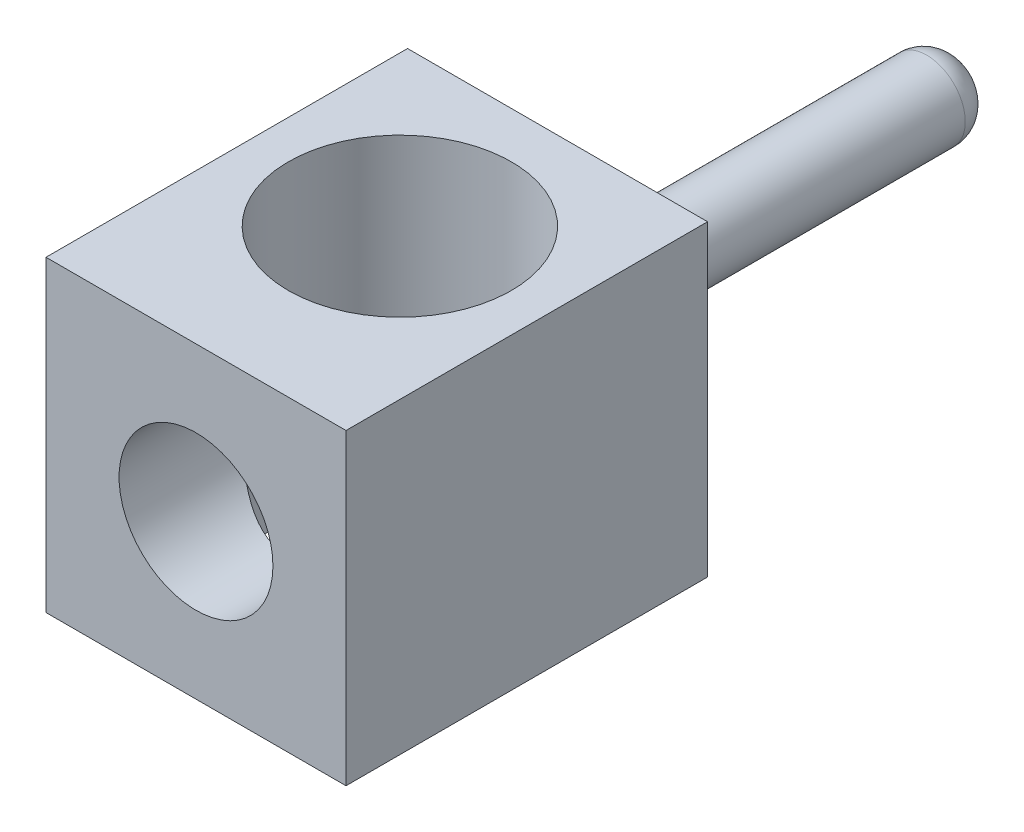
ISO-10303-21;
HEADER;
FILE_DESCRIPTION(('STEP AP214'),'2;1');
FILE_NAME('part.step','',(''),(''),'','','');
FILE_SCHEMA(('AUTOMOTIVE_DESIGN { 1 0 10303 214 1 1 1 1 }'));
ENDSEC;
DATA;
#1=APPLICATION_CONTEXT('core data for automotive mechanical design processes');
#2=APPLICATION_PROTOCOL_DEFINITION('international standard','automotive_design',2000,#1);
#3=PRODUCT_CONTEXT('',#1,'mechanical');
#4=PRODUCT('Part','Part','',(#3));
#5=PRODUCT_RELATED_PRODUCT_CATEGORY('part','',(#4));
#6=PRODUCT_DEFINITION_FORMATION('','',#4);
#7=PRODUCT_DEFINITION_CONTEXT('part definition',#1,'design');
#8=PRODUCT_DEFINITION('design','',#6,#7);
#9=PRODUCT_DEFINITION_SHAPE('','',#8);
#10=(LENGTH_UNIT() NAMED_UNIT(*) SI_UNIT(.MILLI.,.METRE.));
#11=(NAMED_UNIT(*) PLANE_ANGLE_UNIT() SI_UNIT($,.RADIAN.));
#12=(NAMED_UNIT(*) SI_UNIT($,.STERADIAN.) SOLID_ANGLE_UNIT());
#13=UNCERTAINTY_MEASURE_WITH_UNIT(LENGTH_MEASURE(1.E-05),#10,'distance_accuracy_value','');
#14=(GEOMETRIC_REPRESENTATION_CONTEXT(3) GLOBAL_UNCERTAINTY_ASSIGNED_CONTEXT((#13)) GLOBAL_UNIT_ASSIGNED_CONTEXT((#10,
#11,#12)) REPRESENTATION_CONTEXT('',''));
#15=CARTESIAN_POINT('',(0.,0.,0.));
#16=DIRECTION('',(0.,0.,1.));
#17=DIRECTION('',(1.,0.,0.));
#18=AXIS2_PLACEMENT_3D('',#15,#16,#17);
#19=CARTESIAN_POINT('',(0.,0.,-7.25));
#20=DIRECTION('',(0.,0.,-1.));
#21=DIRECTION('',(-1.,0.,0.));
#22=AXIS2_PLACEMENT_3D('',#19,#20,#21);
#23=PLANE('',#22);
#24=CARTESIAN_POINT('',(0.,0.,-7.25));
#25=DIRECTION('',(0.,0.,-1.));
#26=DIRECTION('',(-1.,0.,0.));
#27=AXIS2_PLACEMENT_3D('',#24,#25,#26);
#28=CIRCLE('',#27,0.1);
#29=CARTESIAN_POINT('',(-0.1,0.,-7.25));
#30=VERTEX_POINT('',#29);
#31=EDGE_CURVE('E19',#30,#30,#28,.F.);
#32=ORIENTED_EDGE('',*,*,#31,.F.);
#33=EDGE_LOOP('',(#32));
#34=FACE_BOUND('',#33,.T.);
#35=ADVANCED_FACE('F16',(#34),#23,.T.);
#36=CARTESIAN_POINT('',(0.,0.,-6.85));
#37=DIRECTION('',(0.,0.,-1.));
#38=DIRECTION('',(-1.,0.,0.));
#39=AXIS2_PLACEMENT_3D('',#36,#37,#38);
#40=DEGENERATE_TOROIDAL_SURFACE('',#39,0.1,0.4,.T.);
#41=CARTESIAN_POINT('',(0.,0.,-6.85));
#42=DIRECTION('',(0.,0.,-1.));
#43=DIRECTION('',(-1.,0.,0.));
#44=AXIS2_PLACEMENT_3D('',#41,#42,#43);
#45=CIRCLE('',#44,0.5);
#46=CARTESIAN_POINT('',(-0.5,0.,-6.85));
#47=VERTEX_POINT('',#46);
#48=EDGE_CURVE('E87',#47,#47,#45,.F.);
#49=ORIENTED_EDGE('',*,*,#48,.F.);
#50=EDGE_LOOP('',(#49));
#51=FACE_BOUND('',#50,.T.);
#52=ORIENTED_EDGE('',*,*,#31,.T.);
#53=EDGE_LOOP('',(#52));
#54=FACE_BOUND('',#53,.T.);
#55=ADVANCED_FACE('F130',(#51,#54),#40,.T.);
#56=CARTESIAN_POINT('',(0.,0.,-2.05));
#57=DIRECTION('',(0.,0.,-1.));
#58=DIRECTION('',(-1.,0.,0.));
#59=AXIS2_PLACEMENT_3D('',#56,#57,#58);
#60=CYLINDRICAL_SURFACE('',#59,0.5);
#61=ORIENTED_EDGE('',*,*,#48,.T.);
#62=EDGE_LOOP('',(#61));
#63=FACE_BOUND('',#62,.T.);
#64=CARTESIAN_POINT('',(0.,0.,-2.05));
#65=DIRECTION('',(0.,0.,-1.));
#66=DIRECTION('',(-1.,0.,0.));
#67=AXIS2_PLACEMENT_3D('',#64,#65,#66);
#68=CIRCLE('',#67,0.5);
#69=CARTESIAN_POINT('',(-0.5,0.,-2.05));
#70=VERTEX_POINT('',#69);
#71=EDGE_CURVE('E84',#70,#70,#68,.F.);
#72=ORIENTED_EDGE('',*,*,#71,.F.);
#73=EDGE_LOOP('',(#72));
#74=FACE_BOUND('',#73,.T.);
#75=ADVANCED_FACE('F128',(#63,#74),#60,.T.);
#76=CARTESIAN_POINT('',(-1.95,-2.,-2.05));
#77=DIRECTION('',(-1.,0.,0.));
#78=DIRECTION('',(0.,0.,1.));
#79=AXIS2_PLACEMENT_3D('',#76,#77,#78);
#80=PLANE('',#79);
#81=DIRECTION('',(0.,0.,1.));
#82=VECTOR('',#81,1.);
#83=CARTESIAN_POINT('',(-1.95,2.,0.));
#84=LINE('',#83,#82);
#85=CARTESIAN_POINT('',(-1.95,2.,-2.05));
#86=VERTEX_POINT('',#85);
#87=CARTESIAN_POINT('',(-1.95,2.,2.65));
#88=VERTEX_POINT('',#87);
#89=EDGE_CURVE('E59',#86,#88,#84,.T.);
#90=ORIENTED_EDGE('',*,*,#89,.F.);
#91=DIRECTION('',(0.,1.,0.));
#92=VECTOR('',#91,1.);
#93=CARTESIAN_POINT('',(-1.95,-2.,-2.05));
#94=LINE('',#93,#92);
#95=CARTESIAN_POINT('',(-1.95,-2.,-2.05));
#96=VERTEX_POINT('',#95);
#97=EDGE_CURVE('E53',#96,#86,#94,.T.);
#98=ORIENTED_EDGE('',*,*,#97,.F.);
#99=DIRECTION('',(0.,0.,1.));
#100=VECTOR('',#99,1.);
#101=CARTESIAN_POINT('',(-1.95,-2.,0.));
#102=LINE('',#101,#100);
#103=CARTESIAN_POINT('',(-1.95,-2.,2.65));
#104=VERTEX_POINT('',#103);
#105=EDGE_CURVE('E71',#96,#104,#102,.T.);
#106=ORIENTED_EDGE('',*,*,#105,.T.);
#107=DIRECTION('',(0.,1.,0.));
#108=VECTOR('',#107,1.);
#109=CARTESIAN_POINT('',(-1.95,-2.,2.65));
#110=LINE('',#109,#108);
#111=EDGE_CURVE('E67',#88,#104,#110,.F.);
#112=ORIENTED_EDGE('',*,*,#111,.F.);
#113=EDGE_LOOP('',(#90,#98,#106,#112));
#114=FACE_BOUND('',#113,.T.);
#115=ADVANCED_FACE('F70',(#114),#80,.T.);
#116=CARTESIAN_POINT('',(1.95,-2.,2.65));
#117=DIRECTION('',(1.,0.,0.));
#118=DIRECTION('',(0.,0.,-1.));
#119=AXIS2_PLACEMENT_3D('',#116,#117,#118);
#120=PLANE('',#119);
#121=DIRECTION('',(0.,0.,1.));
#122=VECTOR('',#121,1.);
#123=CARTESIAN_POINT('',(1.95,2.,0.));
#124=LINE('',#123,#122);
#125=CARTESIAN_POINT('',(1.95,2.,2.65));
#126=VERTEX_POINT('',#125);
#127=CARTESIAN_POINT('',(1.95,2.,-2.05));
#128=VERTEX_POINT('',#127);
#129=EDGE_CURVE('E78',#126,#128,#124,.F.);
#130=ORIENTED_EDGE('',*,*,#129,.F.);
#131=DIRECTION('',(0.,1.,0.));
#132=VECTOR('',#131,1.);
#133=CARTESIAN_POINT('',(1.95,-2.,2.65));
#134=LINE('',#133,#132);
#135=CARTESIAN_POINT('',(1.95,-2.,2.65));
#136=VERTEX_POINT('',#135);
#137=EDGE_CURVE('E75',#136,#126,#134,.T.);
#138=ORIENTED_EDGE('',*,*,#137,.F.);
#139=DIRECTION('',(0.,0.,1.));
#140=VECTOR('',#139,1.);
#141=CARTESIAN_POINT('',(1.95,-2.,0.));
#142=LINE('',#141,#140);
#143=CARTESIAN_POINT('',(1.95,-2.,-2.05));
#144=VERTEX_POINT('',#143);
#145=EDGE_CURVE('E157',#136,#144,#142,.F.);
#146=ORIENTED_EDGE('',*,*,#145,.T.);
#147=DIRECTION('',(0.,1.,0.));
#148=VECTOR('',#147,1.);
#149=CARTESIAN_POINT('',(1.95,-2.,-2.05));
#150=LINE('',#149,#148);
#151=EDGE_CURVE('E34',#128,#144,#150,.F.);
#152=ORIENTED_EDGE('',*,*,#151,.F.);
#153=EDGE_LOOP('',(#130,#138,#146,#152));
#154=FACE_BOUND('',#153,.T.);
#155=ADVANCED_FACE('F137',(#154),#120,.T.);
#156=CARTESIAN_POINT('',(1.95,-2.,-2.05));
#157=DIRECTION('',(0.,0.,-1.));
#158=DIRECTION('',(-1.,0.,0.));
#159=AXIS2_PLACEMENT_3D('',#156,#157,#158);
#160=PLANE('',#159);
#161=ORIENTED_EDGE('',*,*,#71,.T.);
#162=EDGE_LOOP('',(#161));
#163=FACE_BOUND('',#162,.T.);
#164=DIRECTION('',(1.,0.,0.));
#165=VECTOR('',#164,1.);
#166=CARTESIAN_POINT('',(0.,2.,-2.05));
#167=LINE('',#166,#165);
#168=EDGE_CURVE('E65',#128,#86,#167,.F.);
#169=ORIENTED_EDGE('',*,*,#168,.F.);
#170=ORIENTED_EDGE('',*,*,#151,.T.);
#171=DIRECTION('',(1.,0.,0.));
#172=VECTOR('',#171,1.);
#173=CARTESIAN_POINT('',(0.,-2.,-2.05));
#174=LINE('',#173,#172);
#175=EDGE_CURVE('E121',#144,#96,#174,.F.);
#176=ORIENTED_EDGE('',*,*,#175,.T.);
#177=ORIENTED_EDGE('',*,*,#97,.T.);
#178=EDGE_LOOP('',(#169,#170,#176,#177));
#179=FACE_BOUND('',#178,.T.);
#180=ADVANCED_FACE('F126',(#163,#179),#160,.T.);
#181=CARTESIAN_POINT('',(-1.95,-2.,2.65));
#182=DIRECTION('',(0.,0.,1.));
#183=DIRECTION('',(1.,0.,0.));
#184=AXIS2_PLACEMENT_3D('',#181,#182,#183);
#185=PLANE('',#184);
#186=CARTESIAN_POINT('',(0.,0.,2.65));
#187=DIRECTION('',(0.,0.,1.));
#188=DIRECTION('',(1.,0.,0.));
#189=AXIS2_PLACEMENT_3D('',#186,#187,#188);
#190=CIRCLE('',#189,1.);
#191=CARTESIAN_POINT('',(1.,0.,2.65));
#192=VERTEX_POINT('',#191);
#193=EDGE_CURVE('E119',#192,#192,#190,.F.);
#194=ORIENTED_EDGE('',*,*,#193,.T.);
#195=EDGE_LOOP('',(#194));
#196=FACE_BOUND('',#195,.T.);
#197=DIRECTION('',(1.,0.,0.));
#198=VECTOR('',#197,1.);
#199=CARTESIAN_POINT('',(0.,2.,2.65));
#200=LINE('',#199,#198);
#201=EDGE_CURVE('E63',#88,#126,#200,.T.);
#202=ORIENTED_EDGE('',*,*,#201,.F.);
#203=ORIENTED_EDGE('',*,*,#111,.T.);
#204=DIRECTION('',(1.,0.,0.));
#205=VECTOR('',#204,1.);
#206=CARTESIAN_POINT('',(0.,-2.,2.65));
#207=LINE('',#206,#205);
#208=EDGE_CURVE('E158',#104,#136,#207,.T.);
#209=ORIENTED_EDGE('',*,*,#208,.T.);
#210=ORIENTED_EDGE('',*,*,#137,.T.);
#211=EDGE_LOOP('',(#202,#203,#209,#210));
#212=FACE_BOUND('',#211,.T.);
#213=ADVANCED_FACE('F77',(#196,#212),#185,.T.);
#214=CARTESIAN_POINT('',(0.,2.,0.));
#215=DIRECTION('',(0.,1.,0.));
#216=DIRECTION('',(0.,0.,1.));
#217=AXIS2_PLACEMENT_3D('',#214,#215,#216);
#218=PLANE('',#217);
#219=CARTESIAN_POINT('',(0.,2.,0.));
#220=DIRECTION('',(0.,1.,0.));
#221=DIRECTION('',(0.,0.,1.));
#222=AXIS2_PLACEMENT_3D('',#219,#220,#221);
#223=CIRCLE('',#222,1.45);
#224=CARTESIAN_POINT('',(0.,2.,1.45));
#225=VERTEX_POINT('',#224);
#226=EDGE_CURVE('E117',#225,#225,#223,.F.);
#227=ORIENTED_EDGE('',*,*,#226,.T.);
#228=EDGE_LOOP('',(#227));
#229=FACE_BOUND('',#228,.T.);
#230=ORIENTED_EDGE('',*,*,#129,.T.);
#231=ORIENTED_EDGE('',*,*,#168,.T.);
#232=ORIENTED_EDGE('',*,*,#89,.T.);
#233=ORIENTED_EDGE('',*,*,#201,.T.);
#234=EDGE_LOOP('',(#230,#231,#232,#233));
#235=FACE_BOUND('',#234,.T.);
#236=ADVANCED_FACE('F61',(#229,#235),#218,.T.);
#237=CARTESIAN_POINT('',(0.,-2.,0.));
#238=DIRECTION('',(0.,1.,0.));
#239=DIRECTION('',(0.,0.,1.));
#240=AXIS2_PLACEMENT_3D('',#237,#238,#239);
#241=PLANE('',#240);
#242=CARTESIAN_POINT('',(0.,-2.,0.));
#243=DIRECTION('',(0.,1.,0.));
#244=DIRECTION('',(0.,0.,1.));
#245=AXIS2_PLACEMENT_3D('',#242,#243,#244);
#246=CIRCLE('',#245,1.45);
#247=CARTESIAN_POINT('',(0.,-2.,1.45));
#248=VERTEX_POINT('',#247);
#249=EDGE_CURVE('E25',#248,#248,#246,.T.);
#250=ORIENTED_EDGE('',*,*,#249,.T.);
#251=EDGE_LOOP('',(#250));
#252=FACE_BOUND('',#251,.T.);
#253=ORIENTED_EDGE('',*,*,#145,.F.);
#254=ORIENTED_EDGE('',*,*,#208,.F.);
#255=ORIENTED_EDGE('',*,*,#105,.F.);
#256=ORIENTED_EDGE('',*,*,#175,.F.);
#257=EDGE_LOOP('',(#253,#254,#255,#256));
#258=FACE_BOUND('',#257,.T.);
#259=ADVANCED_FACE('F108',(#252,#258),#241,.F.);
#260=CARTESIAN_POINT('',(0.,0.,-2.45));
#261=DIRECTION('',(0.,0.,1.));
#262=DIRECTION('',(1.,0.,0.));
#263=AXIS2_PLACEMENT_3D('',#260,#261,#262);
#264=CYLINDRICAL_SURFACE('',#263,1.);
#265=CARTESIAN_POINT('',(1.,0.,1.05));
#266=CARTESIAN_POINT('',(0.999996725643704,-0.0482517987257575,1.05000612932308));
#267=CARTESIAN_POINT('',(0.996474760820935,-0.0965251108616474,1.05339190011236));
#268=CARTESIAN_POINT('',(0.982705903829007,-0.191301132118056,1.06624105463722));
#269=CARTESIAN_POINT('',(0.972444578053392,-0.237799813865637,1.07571748172209));
#270=CARTESIAN_POINT('',(0.946054268870972,-0.327321715685218,1.098992220261));
#271=CARTESIAN_POINT('',(0.929988427354358,-0.370376465799349,1.11274380974269));
#272=CARTESIAN_POINT('',(0.892620323473742,-0.453090195287984,1.14293731606728));
#273=CARTESIAN_POINT('',(0.871317433854384,-0.49274876712531,1.15937955509759));
#274=CARTESIAN_POINT('',(0.819904615492809,-0.574877118400854,1.19642006225725));
#275=CARTESIAN_POINT('',(0.788915013126588,-0.616691171412373,1.21725133928761));
#276=CARTESIAN_POINT('',(0.720781302894773,-0.695107988750181,1.25879733782764));
#277=CARTESIAN_POINT('',(0.683629979695158,-0.731704548880308,1.27951189290077));
#278=CARTESIAN_POINT('',(0.597101021139565,-0.804458699157709,1.32236792019641));
#279=CARTESIAN_POINT('',(0.546718421297894,-0.839615032882322,1.34420991025368));
#280=CARTESIAN_POINT('',(0.438974013192052,-0.900617853198477,1.38313504284213));
#281=CARTESIAN_POINT('',(0.381625958001847,-0.926482298995058,1.40022735083068));
#282=CARTESIAN_POINT('',(0.277414232609106,-0.961887373521371,1.42394017603697));
#283=CARTESIAN_POINT('',(0.231752083179949,-0.973931066199688,1.43213192643762));
#284=CARTESIAN_POINT('',(0.138632656420836,-0.991473511184489,1.44411826343975));
#285=CARTESIAN_POINT('',(0.0911768169200897,-0.99697739565014,1.44791629797786));
#286=CARTESIAN_POINT('',(-0.00426553383050703,-1.0011333214168,1.4507810711633));
#287=CARTESIAN_POINT('',(-0.0522528518637467,-0.999772909557878,1.4498392107334));
#288=CARTESIAN_POINT('',(-0.147226128554041,-0.990254260383141,1.44329198873787));
#289=CARTESIAN_POINT('',(-0.194211796313015,-0.982094075141453,1.43768529084053));
#290=CARTESIAN_POINT('',(-0.284939066334152,-0.959661650952029,1.42245723160389));
#291=CARTESIAN_POINT('',(-0.328727546561413,-0.945518729231144,1.41292091607748));
#292=CARTESIAN_POINT('',(-0.413226302054716,-0.911765440573545,1.39055986458074));
#293=CARTESIAN_POINT('',(-0.453935982456477,-0.892154020464999,1.37773449521355));
#294=CARTESIAN_POINT('',(-0.536094097081039,-0.845622133972977,1.3480428355744));
#295=CARTESIAN_POINT('',(-0.577109879485147,-0.818127424845008,1.33088419018411));
#296=CARTESIAN_POINT('',(-0.654213150738965,-0.757894022770774,1.29472880551493));
#297=CARTESIAN_POINT('',(-0.690295046214466,-0.725149468099605,1.27573002112431));
#298=CARTESIAN_POINT('',(-0.763046597192125,-0.648848419517581,1.23382018458661));
#299=CARTESIAN_POINT('',(-0.798725546995234,-0.604402049692864,1.2108037314741));
#300=CARTESIAN_POINT('',(-0.862338583599139,-0.509539580694058,1.16635128152693));
#301=CARTESIAN_POINT('',(-0.890275785672795,-0.459125894451946,1.14491465152919));
#302=CARTESIAN_POINT('',(-0.931960528926904,-0.36527872096484,1.11107818410096));
#303=CARTESIAN_POINT('',(-0.947499585693051,-0.32298548934233,1.09773832206891));
#304=CARTESIAN_POINT('',(-0.97289059763568,-0.235675022224082,1.07530137829489));
#305=CARTESIAN_POINT('',(-0.982753128184936,-0.190663025864342,1.06619641305196));
#306=CARTESIAN_POINT('',(-0.996237860705247,-0.0984645416749249,1.05361366770527));
#307=CARTESIAN_POINT('',(-0.999802128199773,-0.0512619237132155,1.05018814743777));
#308=CARTESIAN_POINT('',(-1.00018160072331,0.0431944281756988,1.04982734865734));
#309=CARTESIAN_POINT('',(-0.996997898169166,0.0904481525915757,1.05289101962075));
#310=CARTESIAN_POINT('',(-0.984994275463162,0.177394794765406,1.06411396640184));
#311=CARTESIAN_POINT('',(-0.976934196236485,0.217290758562537,1.07158334725145));
#312=CARTESIAN_POINT('',(-0.956324752607989,0.295066383264977,1.09001556126637));
#313=CARTESIAN_POINT('',(-0.943770974186974,0.332944019453802,1.10098182815233));
#314=CARTESIAN_POINT('',(-0.907851093746579,0.423251092557616,1.13096117236591));
#315=CARTESIAN_POINT('',(-0.882169834331485,0.474303100400254,1.15134959591115));
#316=CARTESIAN_POINT('',(-0.823082094428914,0.570740386392268,1.19430934619138));
#317=CARTESIAN_POINT('',(-0.789660861423204,0.616114584871877,1.21688479301509));
#318=CARTESIAN_POINT('',(-0.71504235779697,0.701409222610374,1.26220148620673));
#319=CARTESIAN_POINT('',(-0.673726782568366,0.741228258873085,1.28493939984662));
#320=CARTESIAN_POINT('',(-0.584175237836733,0.813661618934085,1.3280440535197));
#321=CARTESIAN_POINT('',(-0.535950004838518,0.846286924575523,1.34841438506813));
#322=CARTESIAN_POINT('',(-0.441980941567907,0.898347691706031,1.38173859538151));
#323=CARTESIAN_POINT('',(-0.397196798201002,0.919080688293006,1.39536412200676));
#324=CARTESIAN_POINT('',(-0.304122229130352,0.95392535219687,1.41855691968489));
#325=CARTESIAN_POINT('',(-0.255834022761708,0.968041169027562,1.42812673363962));
#326=CARTESIAN_POINT('',(-0.156702255617866,0.988949854787801,1.44238086274647));
#327=CARTESIAN_POINT('',(-0.105846598846534,0.995703847845251,1.44703923768081));
#328=CARTESIAN_POINT('',(-0.00349703989022985,1.00130490783963,1.45089864479629));
#329=CARTESIAN_POINT('',(0.0479966665191871,1.00015434299577,1.45010131151735));
#330=CARTESIAN_POINT('',(0.145282797595632,0.990489501622737,1.44345403745471));
#331=CARTESIAN_POINT('',(0.191175399036833,0.982638297589703,1.4380591256766));
#332=CARTESIAN_POINT('',(0.280816180484098,0.960869857616101,1.42327342217792));
#333=CARTESIAN_POINT('',(0.324563927895469,0.946951403527973,1.41388182803544));
#334=CARTESIAN_POINT('',(0.410834519907648,0.91293920373988,1.39132632330768));
#335=CARTESIAN_POINT('',(0.453223899420399,0.89260575089083,1.37801762484737));
#336=CARTESIAN_POINT('',(0.53405571411598,0.846727157387102,1.34875316978896));
#337=CARTESIAN_POINT('',(0.57249729337002,0.821180890105015,1.3327968411073));
#338=CARTESIAN_POINT('',(0.650785726966259,0.761105688034018,1.29657906594809));
#339=CARTESIAN_POINT('',(0.689902319812065,0.725795865951561,1.27603524588167));
#340=CARTESIAN_POINT('',(0.762063566126967,0.64962955363811,1.23430239761791));
#341=CARTESIAN_POINT('',(0.795094617202545,0.608760984323835,1.21311204452715));
#342=CARTESIAN_POINT('',(0.858935227231604,0.515625598011027,1.16894817929581));
#343=CARTESIAN_POINT('',(0.888729544549019,0.462565245292854,1.14616113640831));
#344=CARTESIAN_POINT('',(0.938613942530698,0.350340654987329,1.10568604374131));
#345=CARTESIAN_POINT('',(0.958740645115571,0.291200499250315,1.08797885533787));
#346=CARTESIAN_POINT('',(0.98200984024629,0.192647858052323,1.0669101272786));
#347=CARTESIAN_POINT('',(0.988721694311642,0.154692250556812,1.06064454216192));
#348=CARTESIAN_POINT('',(0.997715855623999,0.0778284255936065,1.05218906672028));
#349=CARTESIAN_POINT('',(1.00000264118474,0.03892121161881,1.0499950559215));
#350=CARTESIAN_POINT('',(1.,0.,1.05));
#351=B_SPLINE_CURVE_WITH_KNOTS('',3,(#265,#266,#267,#268,#269,#270,#271,#272,#273,#274,#275,
#276,#277,#278,#279,#280,#281,#282,#283,#284,#285,#286,#287,#288,#289,#290,#291,#292,#293,#294,
#295,#296,#297,#298,#299,#300,#301,#302,#303,#304,#305,#306,#307,#308,#309,#310,#311,#312,#313,
#314,#315,#316,#317,#318,#319,#320,#321,#322,#323,#324,#325,#326,#327,#328,#329,#330,#331,#332,
#333,#334,#335,#336,#337,#338,#339,#340,#341,#342,#343,#344,#345,#346,#347,#348,#349,#350),
.UNSPECIFIED.,.T.,.F.,(4,2,2,2,2,2,2,2,2,2,2,2,2,2,2,2,2,2,2,2,2,2,2,2,2,2,2,2,2,2,2,2,2,2,2,2,
2,2,2,2,2,2,4),(0.,0.144571043253029,0.289452726644265,0.432803622514584,0.57617169628003,
0.743743677348844,0.911513287749978,1.10604512960516,1.30019893467817,1.44336726334475,
1.58642316532782,1.72973869157191,1.87309528742484,2.0134999365063,2.15393164465633,
2.31017075135729,2.46658553784378,2.65022382079082,2.83378810018362,2.97425316484043,
3.11445568880446,3.25594127885414,3.39740396580346,3.5210614036015,3.64484064102872,
3.82590023078954,4.00730780549778,4.19168412604456,4.37577700115985,4.52873576784842,
4.68159848812536,4.83526458326921,4.98888464179335,5.12886116485338,5.26886580454774,
5.41488796746917,5.56094172314171,5.72997164923816,5.89937492462638,6.09332225174408,
6.28652897621346,6.40326210664389,6.51987703742365),.UNSPECIFIED.);
#352=CARTESIAN_POINT('',(1.,0.,1.05));
#353=VERTEX_POINT('',#352);
#354=EDGE_CURVE('E11',#353,#353,#351,.T.);
#355=ORIENTED_EDGE('',*,*,#354,.T.);
#356=EDGE_LOOP('',(#355));
#357=FACE_BOUND('',#356,.T.);
#358=ORIENTED_EDGE('',*,*,#193,.F.);
#359=EDGE_LOOP('',(#358));
#360=FACE_BOUND('',#359,.T.);
#361=ADVANCED_FACE('F97',(#357,#360),#264,.F.);
#362=CARTESIAN_POINT('',(0.,-2.,0.));
#363=DIRECTION('',(0.,1.,0.));
#364=DIRECTION('',(0.,0.,1.));
#365=AXIS2_PLACEMENT_3D('',#362,#363,#364);
#366=CYLINDRICAL_SURFACE('',#365,1.45);
#367=ORIENTED_EDGE('',*,*,#354,.F.);
#368=EDGE_LOOP('',(#367));
#369=FACE_BOUND('',#368,.T.);
#370=ORIENTED_EDGE('',*,*,#249,.F.);
#371=EDGE_LOOP('',(#370));
#372=FACE_BOUND('',#371,.T.);
#373=ORIENTED_EDGE('',*,*,#226,.F.);
#374=EDGE_LOOP('',(#373));
#375=FACE_BOUND('',#374,.T.);
#376=ADVANCED_FACE('F100',(#369,#372,#375),#366,.F.);
#377=CLOSED_SHELL('',(#35,#55,#75,#115,#155,#180,#213,#236,#259,#361,#376));
#378=MANIFOLD_SOLID_BREP('B1',#377);
#379=ADVANCED_BREP_SHAPE_REPRESENTATION('',(#18,#378),#14);
#380=SHAPE_DEFINITION_REPRESENTATION(#9,#379);
ENDSEC;
END-ISO-10303-21;
